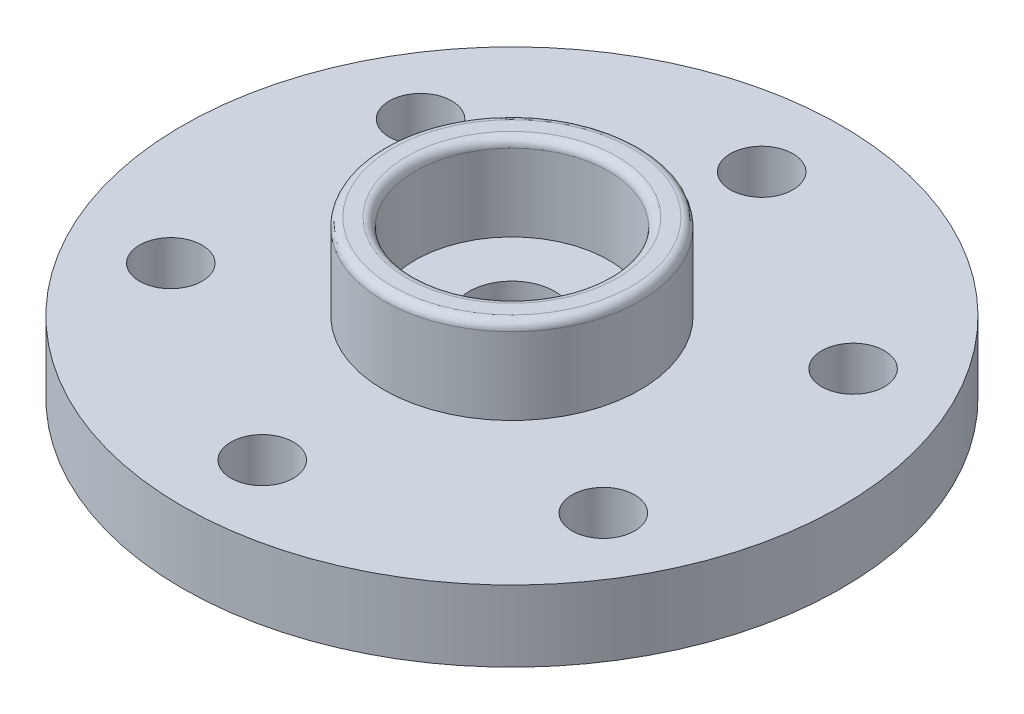
ISO-10303-21;
HEADER;
FILE_DESCRIPTION(('STEP AP214'),'2;1');
FILE_NAME('part.step','',(''),(''),'','','');
FILE_SCHEMA(('AUTOMOTIVE_DESIGN { 1 0 10303 214 1 1 1 1 }'));
ENDSEC;
DATA;
#1=APPLICATION_CONTEXT('core data for automotive mechanical design processes');
#2=APPLICATION_PROTOCOL_DEFINITION('international standard','automotive_design',2000,#1);
#3=PRODUCT_CONTEXT('',#1,'mechanical');
#4=PRODUCT('Part','Part','',(#3));
#5=PRODUCT_RELATED_PRODUCT_CATEGORY('part','',(#4));
#6=PRODUCT_DEFINITION_FORMATION('','',#4);
#7=PRODUCT_DEFINITION_CONTEXT('part definition',#1,'design');
#8=PRODUCT_DEFINITION('design','',#6,#7);
#9=PRODUCT_DEFINITION_SHAPE('','',#8);
#10=(LENGTH_UNIT() NAMED_UNIT(*) SI_UNIT(.MILLI.,.METRE.));
#11=(NAMED_UNIT(*) PLANE_ANGLE_UNIT() SI_UNIT($,.RADIAN.));
#12=(NAMED_UNIT(*) SI_UNIT($,.STERADIAN.) SOLID_ANGLE_UNIT());
#13=UNCERTAINTY_MEASURE_WITH_UNIT(LENGTH_MEASURE(1.E-05),#10,'distance_accuracy_value','');
#14=(GEOMETRIC_REPRESENTATION_CONTEXT(3) GLOBAL_UNCERTAINTY_ASSIGNED_CONTEXT((#13)) GLOBAL_UNIT_ASSIGNED_CONTEXT((#10,
#11,#12)) REPRESENTATION_CONTEXT('',''));
#15=CARTESIAN_POINT('',(0.,0.,0.));
#16=DIRECTION('',(0.,0.,1.));
#17=DIRECTION('',(1.,0.,0.));
#18=AXIS2_PLACEMENT_3D('',#15,#16,#17);
#19=CARTESIAN_POINT('',(0.,0.,0.));
#20=DIRECTION('',(0.,1.,0.));
#21=DIRECTION('',(0.,0.,1.));
#22=AXIS2_PLACEMENT_3D('',#19,#20,#21);
#23=PLANE('',#22);
#24=CARTESIAN_POINT('',(0.,0.,0.));
#25=DIRECTION('',(0.,1.,0.));
#26=DIRECTION('',(0.,0.,1.));
#27=AXIS2_PLACEMENT_3D('',#24,#25,#26);
#28=CIRCLE('',#27,3.1);
#29=CARTESIAN_POINT('',(0.,0.,3.1));
#30=VERTEX_POINT('',#29);
#31=EDGE_CURVE('E44',#30,#30,#28,.T.);
#32=ORIENTED_EDGE('',*,*,#31,.T.);
#33=EDGE_LOOP('',(#32));
#34=FACE_BOUND('',#33,.T.);
#35=CARTESIAN_POINT('',(0.,0.,0.));
#36=DIRECTION('',(0.,1.,0.));
#37=DIRECTION('',(0.,0.,1.));
#38=AXIS2_PLACEMENT_3D('',#35,#36,#37);
#39=CIRCLE('',#38,3.2);
#40=CARTESIAN_POINT('',(0.,0.,3.2));
#41=VERTEX_POINT('',#40);
#42=EDGE_CURVE('E48',#41,#41,#39,.F.);
#43=ORIENTED_EDGE('',*,*,#42,.T.);
#44=EDGE_LOOP('',(#43));
#45=FACE_BOUND('',#44,.T.);
#46=ADVANCED_FACE('F33',(#34,#45),#23,.F.);
#47=CARTESIAN_POINT('',(0.,2.5,0.));
#48=DIRECTION('',(0.,1.,0.));
#49=DIRECTION('',(0.,0.,1.));
#50=AXIS2_PLACEMENT_3D('',#47,#48,#49);
#51=PLANE('',#50);
#52=CARTESIAN_POINT('',(-7.59590881659326,2.5,-4.38550000000009));
#53=DIRECTION('',(0.,1.,0.));
#54=DIRECTION('',(0.,0.,1.));
#55=AXIS2_PLACEMENT_3D('',#52,#53,#54);
#56=CIRCLE('',#55,1.1);
#57=CARTESIAN_POINT('',(-7.59590881659326,2.5,-3.28550000000009));
#58=VERTEX_POINT('',#57);
#59=EDGE_CURVE('E129',#58,#58,#56,.F.);
#60=ORIENTED_EDGE('',*,*,#59,.T.);
#61=EDGE_LOOP('',(#60));
#62=FACE_BOUND('',#61,.T.);
#63=CARTESIAN_POINT('',(-7.59590881659335,2.5,4.38549999999993));
#64=DIRECTION('',(0.,1.,0.));
#65=DIRECTION('',(0.,0.,1.));
#66=AXIS2_PLACEMENT_3D('',#63,#64,#65);
#67=CIRCLE('',#66,1.1);
#68=CARTESIAN_POINT('',(-7.59590881659335,2.5,5.48549999999993));
#69=VERTEX_POINT('',#68);
#70=EDGE_CURVE('E123',#69,#69,#67,.F.);
#71=ORIENTED_EDGE('',*,*,#70,.T.);
#72=EDGE_LOOP('',(#71));
#73=FACE_BOUND('',#72,.T.);
#74=CARTESIAN_POINT('',(0.,2.5,8.771));
#75=DIRECTION('',(0.,1.,0.));
#76=DIRECTION('',(0.,0.,1.));
#77=AXIS2_PLACEMENT_3D('',#74,#75,#76);
#78=CIRCLE('',#77,1.1);
#79=CARTESIAN_POINT('',(0.,2.5,9.871));
#80=VERTEX_POINT('',#79);
#81=EDGE_CURVE('E117',#80,#80,#78,.F.);
#82=ORIENTED_EDGE('',*,*,#81,.T.);
#83=EDGE_LOOP('',(#82));
#84=FACE_BOUND('',#83,.T.);
#85=CARTESIAN_POINT('',(7.59590881659329,2.5,4.38550000000004));
#86=DIRECTION('',(0.,1.,0.));
#87=DIRECTION('',(0.,0.,1.));
#88=AXIS2_PLACEMENT_3D('',#85,#86,#87);
#89=CIRCLE('',#88,1.1);
#90=CARTESIAN_POINT('',(7.59590881659329,2.5,5.48550000000004));
#91=VERTEX_POINT('',#90);
#92=EDGE_CURVE('E111',#91,#91,#89,.F.);
#93=ORIENTED_EDGE('',*,*,#92,.T.);
#94=EDGE_LOOP('',(#93));
#95=FACE_BOUND('',#94,.T.);
#96=CARTESIAN_POINT('',(7.59590881659332,2.5,-4.38549999999998));
#97=DIRECTION('',(0.,1.,0.));
#98=DIRECTION('',(0.,0.,1.));
#99=AXIS2_PLACEMENT_3D('',#96,#97,#98);
#100=CIRCLE('',#99,1.1);
#101=CARTESIAN_POINT('',(7.59590881659332,2.5,-3.28549999999998));
#102=VERTEX_POINT('',#101);
#103=EDGE_CURVE('E105',#102,#102,#100,.F.);
#104=ORIENTED_EDGE('',*,*,#103,.T.);
#105=EDGE_LOOP('',(#104));
#106=FACE_BOUND('',#105,.T.);
#107=CARTESIAN_POINT('',(0.,2.5,-8.771));
#108=DIRECTION('',(0.,1.,0.));
#109=DIRECTION('',(0.,0.,1.));
#110=AXIS2_PLACEMENT_3D('',#107,#108,#109);
#111=CIRCLE('',#110,1.1);
#112=CARTESIAN_POINT('',(0.,2.5,-7.671));
#113=VERTEX_POINT('',#112);
#114=EDGE_CURVE('E99',#113,#113,#111,.F.);
#115=ORIENTED_EDGE('',*,*,#114,.T.);
#116=EDGE_LOOP('',(#115));
#117=FACE_BOUND('',#116,.T.);
#118=CARTESIAN_POINT('',(0.,2.5,0.));
#119=DIRECTION('',(0.,1.,0.));
#120=DIRECTION('',(0.,0.,1.));
#121=AXIS2_PLACEMENT_3D('',#118,#119,#120);
#122=CIRCLE('',#121,11.575);
#123=CARTESIAN_POINT('',(0.,2.5,11.575));
#124=VERTEX_POINT('',#123);
#125=EDGE_CURVE('E79',#124,#124,#122,.T.);
#126=ORIENTED_EDGE('',*,*,#125,.T.);
#127=EDGE_LOOP('',(#126));
#128=FACE_BOUND('',#127,.T.);
#129=CARTESIAN_POINT('',(0.,2.5,0.));
#130=DIRECTION('',(0.,1.,0.));
#131=DIRECTION('',(0.,0.,1.));
#132=AXIS2_PLACEMENT_3D('',#129,#130,#131);
#133=CIRCLE('',#132,4.5);
#134=CARTESIAN_POINT('',(0.,2.5,4.5));
#135=VERTEX_POINT('',#134);
#136=EDGE_CURVE('E83',#135,#135,#133,.T.);
#137=ORIENTED_EDGE('',*,*,#136,.F.);
#138=EDGE_LOOP('',(#137));
#139=FACE_BOUND('',#138,.T.);
#140=ADVANCED_FACE('F158',(#62,#73,#84,#95,#106,#117,#128,#139),#51,.T.);
#141=CARTESIAN_POINT('',(0.,2.5,0.));
#142=DIRECTION('',(0.,-1.,0.));
#143=DIRECTION('',(0.,0.,-1.));
#144=AXIS2_PLACEMENT_3D('',#141,#142,#143);
#145=CYLINDRICAL_SURFACE('',#144,11.575);
#146=ORIENTED_EDGE('',*,*,#125,.F.);
#147=EDGE_LOOP('',(#146));
#148=FACE_BOUND('',#147,.T.);
#149=CARTESIAN_POINT('',(0.,0.,0.));
#150=DIRECTION('',(0.,1.,0.));
#151=DIRECTION('',(0.,0.,1.));
#152=AXIS2_PLACEMENT_3D('',#149,#150,#151);
#153=CIRCLE('',#152,11.575);
#154=CARTESIAN_POINT('',(0.,0.,11.575));
#155=VERTEX_POINT('',#154);
#156=EDGE_CURVE('E80',#155,#155,#153,.T.);
#157=ORIENTED_EDGE('',*,*,#156,.T.);
#158=EDGE_LOOP('',(#157));
#159=FACE_BOUND('',#158,.T.);
#160=ADVANCED_FACE('F141',(#148,#159),#145,.T.);
#161=CARTESIAN_POINT('',(-7.59590881659326,0.,-4.38550000000009));
#162=DIRECTION('',(0.,-1.,0.));
#163=DIRECTION('',(-0.866025403784433,0.,-0.50000000000001));
#164=AXIS2_PLACEMENT_3D('',#161,#162,#163);
#165=CIRCLE('',#164,1.1);
#166=CARTESIAN_POINT('',(-8.54853676075614,0.,-4.9355000000001));
#167=VERTEX_POINT('',#166);
#168=EDGE_CURVE('E126',#167,#167,#165,.T.);
#169=ORIENTED_EDGE('',*,*,#168,.F.);
#170=EDGE_LOOP('',(#169));
#171=FACE_BOUND('',#170,.T.);
#172=CARTESIAN_POINT('',(-7.59590881659335,0.,4.38549999999993));
#173=DIRECTION('',(0.,-1.,0.));
#174=DIRECTION('',(-0.866025403784443,0.,0.499999999999992));
#175=AXIS2_PLACEMENT_3D('',#172,#173,#174);
#176=CIRCLE('',#175,1.1);
#177=CARTESIAN_POINT('',(-8.54853676075624,0.,4.93549999999992));
#178=VERTEX_POINT('',#177);
#179=EDGE_CURVE('E120',#178,#178,#176,.T.);
#180=ORIENTED_EDGE('',*,*,#179,.F.);
#181=EDGE_LOOP('',(#180));
#182=FACE_BOUND('',#181,.T.);
#183=CARTESIAN_POINT('',(0.,0.,8.771));
#184=DIRECTION('',(0.,-1.,0.));
#185=DIRECTION('',(0.,0.,1.));
#186=AXIS2_PLACEMENT_3D('',#183,#184,#185);
#187=CIRCLE('',#186,1.1);
#188=CARTESIAN_POINT('',(0.,0.,9.871));
#189=VERTEX_POINT('',#188);
#190=EDGE_CURVE('E114',#189,#189,#187,.T.);
#191=ORIENTED_EDGE('',*,*,#190,.F.);
#192=EDGE_LOOP('',(#191));
#193=FACE_BOUND('',#192,.T.);
#194=CARTESIAN_POINT('',(7.59590881659329,0.,4.38550000000004));
#195=DIRECTION('',(0.,-1.,0.));
#196=DIRECTION('',(0.866025403784436,0.,0.500000000000004));
#197=AXIS2_PLACEMENT_3D('',#194,#195,#196);
#198=CIRCLE('',#197,1.1);
#199=CARTESIAN_POINT('',(8.54853676075617,0.,4.93550000000004));
#200=VERTEX_POINT('',#199);
#201=EDGE_CURVE('E108',#200,#200,#198,.T.);
#202=ORIENTED_EDGE('',*,*,#201,.F.);
#203=EDGE_LOOP('',(#202));
#204=FACE_BOUND('',#203,.T.);
#205=CARTESIAN_POINT('',(7.59590881659332,0.,-4.38549999999998));
#206=DIRECTION('',(0.,-1.,0.));
#207=DIRECTION('',(0.86602540378444,0.,-0.499999999999998));
#208=AXIS2_PLACEMENT_3D('',#205,#206,#207);
#209=CIRCLE('',#208,1.1);
#210=CARTESIAN_POINT('',(8.54853676075621,0.,-4.93549999999998));
#211=VERTEX_POINT('',#210);
#212=EDGE_CURVE('E102',#211,#211,#209,.T.);
#213=ORIENTED_EDGE('',*,*,#212,.F.);
#214=EDGE_LOOP('',(#213));
#215=FACE_BOUND('',#214,.T.);
#216=CARTESIAN_POINT('',(0.,0.,-8.771));
#217=DIRECTION('',(0.,-1.,0.));
#218=DIRECTION('',(0.,0.,-1.));
#219=AXIS2_PLACEMENT_3D('',#216,#217,#218);
#220=CIRCLE('',#219,1.1);
#221=CARTESIAN_POINT('',(0.,0.,-9.871));
#222=VERTEX_POINT('',#221);
#223=EDGE_CURVE('E98',#222,#222,#220,.T.);
#224=ORIENTED_EDGE('',*,*,#223,.F.);
#225=EDGE_LOOP('',(#224));
#226=FACE_BOUND('',#225,.T.);
#227=CARTESIAN_POINT('',(0.,0.,0.));
#228=DIRECTION('',(0.,1.,0.));
#229=DIRECTION('',(0.,0.,1.));
#230=AXIS2_PLACEMENT_3D('',#227,#228,#229);
#231=CIRCLE('',#230,4.8);
#232=CARTESIAN_POINT('',(0.,0.,4.8));
#233=VERTEX_POINT('',#232);
#234=EDGE_CURVE('E56',#233,#233,#231,.T.);
#235=ORIENTED_EDGE('',*,*,#234,.T.);
#236=EDGE_LOOP('',(#235));
#237=FACE_BOUND('',#236,.T.);
#238=ORIENTED_EDGE('',*,*,#156,.F.);
#239=EDGE_LOOP('',(#238));
#240=FACE_BOUND('',#239,.T.);
#241=ADVANCED_FACE('F137',(#171,#182,#193,#204,#215,#226,#237,#240),#23,.F.);
#242=CARTESIAN_POINT('',(0.,5.5,0.));
#243=DIRECTION('',(0.,1.,0.));
#244=DIRECTION('',(0.,0.,1.));
#245=AXIS2_PLACEMENT_3D('',#242,#243,#244);
#246=PLANE('',#245);
#247=CARTESIAN_POINT('',(0.,5.5,0.));
#248=DIRECTION('',(0.,1.,0.));
#249=DIRECTION('',(0.,0.,1.));
#250=AXIS2_PLACEMENT_3D('',#247,#248,#249);
#251=CIRCLE('',#250,3.7);
#252=CARTESIAN_POINT('',(0.,5.5,3.7));
#253=VERTEX_POINT('',#252);
#254=EDGE_CURVE('E62',#253,#253,#251,.F.);
#255=ORIENTED_EDGE('',*,*,#254,.T.);
#256=EDGE_LOOP('',(#255));
#257=FACE_BOUND('',#256,.T.);
#258=CARTESIAN_POINT('',(0.,5.5,0.));
#259=DIRECTION('',(0.,1.,0.));
#260=DIRECTION('',(0.,0.,1.));
#261=AXIS2_PLACEMENT_3D('',#258,#259,#260);
#262=CIRCLE('',#261,4.2);
#263=CARTESIAN_POINT('',(0.,5.5,4.2));
#264=VERTEX_POINT('',#263);
#265=EDGE_CURVE('E65',#264,#264,#262,.T.);
#266=ORIENTED_EDGE('',*,*,#265,.T.);
#267=EDGE_LOOP('',(#266));
#268=FACE_BOUND('',#267,.T.);
#269=ADVANCED_FACE('F140',(#257,#268),#246,.T.);
#270=CARTESIAN_POINT('',(0.,5.5,0.));
#271=DIRECTION('',(0.,-1.,0.));
#272=DIRECTION('',(0.,0.,-1.));
#273=AXIS2_PLACEMENT_3D('',#270,#271,#272);
#274=CYLINDRICAL_SURFACE('',#273,4.5);
#275=CARTESIAN_POINT('',(0.,5.2,0.));
#276=DIRECTION('',(0.,1.,0.));
#277=DIRECTION('',(0.,0.,1.));
#278=AXIS2_PLACEMENT_3D('',#275,#276,#277);
#279=CIRCLE('',#278,4.5);
#280=CARTESIAN_POINT('',(0.,5.2,4.5));
#281=VERTEX_POINT('',#280);
#282=EDGE_CURVE('E11',#281,#281,#279,.F.);
#283=ORIENTED_EDGE('',*,*,#282,.T.);
#284=EDGE_LOOP('',(#283));
#285=FACE_BOUND('',#284,.T.);
#286=ORIENTED_EDGE('',*,*,#136,.T.);
#287=EDGE_LOOP('',(#286));
#288=FACE_BOUND('',#287,.T.);
#289=ADVANCED_FACE('F179',(#285,#288),#274,.T.);
#290=CARTESIAN_POINT('',(0.,5.5,0.));
#291=DIRECTION('',(0.,-1.,0.));
#292=DIRECTION('',(0.,0.,-1.));
#293=AXIS2_PLACEMENT_3D('',#290,#291,#292);
#294=CYLINDRICAL_SURFACE('',#293,3.4);
#295=CARTESIAN_POINT('',(0.,5.2,0.));
#296=DIRECTION('',(0.,1.,0.));
#297=DIRECTION('',(0.,0.,1.));
#298=AXIS2_PLACEMENT_3D('',#295,#296,#297);
#299=CIRCLE('',#298,3.4);
#300=CARTESIAN_POINT('',(0.,5.2,3.4));
#301=VERTEX_POINT('',#300);
#302=EDGE_CURVE('E68',#301,#301,#299,.T.);
#303=ORIENTED_EDGE('',*,*,#302,.T.);
#304=EDGE_LOOP('',(#303));
#305=FACE_BOUND('',#304,.T.);
#306=CARTESIAN_POINT('',(0.,2.5,0.));
#307=DIRECTION('',(0.,1.,0.));
#308=DIRECTION('',(0.,0.,1.));
#309=AXIS2_PLACEMENT_3D('',#306,#307,#308);
#310=CIRCLE('',#309,3.4);
#311=CARTESIAN_POINT('',(0.,2.5,3.4));
#312=VERTEX_POINT('',#311);
#313=EDGE_CURVE('E71',#312,#312,#310,.F.);
#314=ORIENTED_EDGE('',*,*,#313,.T.);
#315=EDGE_LOOP('',(#314));
#316=FACE_BOUND('',#315,.T.);
#317=ADVANCED_FACE('F177',(#305,#316),#294,.F.);
#318=CARTESIAN_POINT('',(0.,2.5,0.));
#319=DIRECTION('',(0.,1.,0.));
#320=DIRECTION('',(0.,0.,1.));
#321=AXIS2_PLACEMENT_3D('',#318,#319,#320);
#322=CIRCLE('',#321,1.5);
#323=CARTESIAN_POINT('',(0.,2.5,1.5));
#324=VERTEX_POINT('',#323);
#325=EDGE_CURVE('E75',#324,#324,#322,.F.);
#326=ORIENTED_EDGE('',*,*,#325,.T.);
#327=EDGE_LOOP('',(#326));
#328=FACE_BOUND('',#327,.T.);
#329=ORIENTED_EDGE('',*,*,#313,.F.);
#330=EDGE_LOOP('',(#329));
#331=FACE_BOUND('',#330,.T.);
#332=ADVANCED_FACE('F166',(#328,#331),#51,.T.);
#333=CARTESIAN_POINT('',(0.,5.501,0.));
#334=DIRECTION('',(0.,-1.,0.));
#335=DIRECTION('',(0.,0.,-1.));
#336=AXIS2_PLACEMENT_3D('',#333,#334,#335);
#337=CYLINDRICAL_SURFACE('',#336,1.5);
#338=CARTESIAN_POINT('',(0.,1.,0.));
#339=DIRECTION('',(0.,1.,0.));
#340=DIRECTION('',(0.,0.,1.));
#341=AXIS2_PLACEMENT_3D('',#338,#339,#340);
#342=CIRCLE('',#341,1.5);
#343=CARTESIAN_POINT('',(0.,1.,1.5));
#344=VERTEX_POINT('',#343);
#345=EDGE_CURVE('E72',#344,#344,#342,.F.);
#346=ORIENTED_EDGE('',*,*,#345,.T.);
#347=EDGE_LOOP('',(#346));
#348=FACE_BOUND('',#347,.T.);
#349=ORIENTED_EDGE('',*,*,#325,.F.);
#350=EDGE_LOOP('',(#349));
#351=FACE_BOUND('',#350,.T.);
#352=ADVANCED_FACE('F176',(#348,#351),#337,.F.);
#353=CARTESIAN_POINT('',(0.,1.,0.));
#354=DIRECTION('',(0.,1.,0.));
#355=DIRECTION('',(0.,0.,1.));
#356=AXIS2_PLACEMENT_3D('',#353,#354,#355);
#357=PLANE('',#356);
#358=CARTESIAN_POINT('',(0.,0.999999999999999,0.));
#359=DIRECTION('',(0.,1.,0.));
#360=DIRECTION('',(0.,0.,1.));
#361=AXIS2_PLACEMENT_3D('',#358,#359,#360);
#362=CIRCLE('',#361,2.8);
#363=CARTESIAN_POINT('',(0.,0.999999999999999,2.8));
#364=VERTEX_POINT('',#363);
#365=EDGE_CURVE('E76',#364,#364,#362,.F.);
#366=ORIENTED_EDGE('',*,*,#365,.T.);
#367=EDGE_LOOP('',(#366));
#368=FACE_BOUND('',#367,.T.);
#369=ORIENTED_EDGE('',*,*,#345,.F.);
#370=EDGE_LOOP('',(#369));
#371=FACE_BOUND('',#370,.T.);
#372=ADVANCED_FACE('F190',(#368,#371),#357,.F.);
#373=CARTESIAN_POINT('',(0.,10.4195959492893,0.));
#374=DIRECTION('',(0.,-1.,0.));
#375=DIRECTION('',(0.,0.,-1.));
#376=AXIS2_PLACEMENT_3D('',#373,#374,#375);
#377=CYLINDRICAL_SURFACE('',#376,2.8);
#378=CARTESIAN_POINT('',(0.,0.3,0.));
#379=DIRECTION('',(0.,1.,0.));
#380=DIRECTION('',(0.,0.,1.));
#381=AXIS2_PLACEMENT_3D('',#378,#379,#380);
#382=CIRCLE('',#381,2.8);
#383=CARTESIAN_POINT('',(0.,0.3,2.8));
#384=VERTEX_POINT('',#383);
#385=EDGE_CURVE('E53',#384,#384,#382,.F.);
#386=ORIENTED_EDGE('',*,*,#385,.T.);
#387=EDGE_LOOP('',(#386));
#388=FACE_BOUND('',#387,.T.);
#389=ORIENTED_EDGE('',*,*,#365,.F.);
#390=EDGE_LOOP('',(#389));
#391=FACE_BOUND('',#390,.T.);
#392=ADVANCED_FACE('F194',(#388,#391),#377,.F.);
#393=CARTESIAN_POINT('',(0.,0.5,0.));
#394=DIRECTION('',(0.,-1.,0.));
#395=DIRECTION('',(0.,0.,-1.));
#396=AXIS2_PLACEMENT_3D('',#393,#394,#395);
#397=CYLINDRICAL_SURFACE('',#396,4.5);
#398=CARTESIAN_POINT('',(0.,0.3,0.));
#399=DIRECTION('',(0.,1.,0.));
#400=DIRECTION('',(0.,0.,1.));
#401=AXIS2_PLACEMENT_3D('',#398,#399,#400);
#402=CIRCLE('',#401,4.5);
#403=CARTESIAN_POINT('',(0.,0.3,4.5));
#404=VERTEX_POINT('',#403);
#405=EDGE_CURVE('E59',#404,#404,#402,.F.);
#406=ORIENTED_EDGE('',*,*,#405,.T.);
#407=EDGE_LOOP('',(#406));
#408=FACE_BOUND('',#407,.T.);
#409=CARTESIAN_POINT('',(0.,0.5,0.));
#410=DIRECTION('',(0.,-1.,0.));
#411=DIRECTION('',(0.,0.,-1.));
#412=AXIS2_PLACEMENT_3D('',#409,#410,#411);
#413=CIRCLE('',#412,4.5);
#414=CARTESIAN_POINT('',(0.,0.5,-4.5));
#415=VERTEX_POINT('',#414);
#416=EDGE_CURVE('E92',#415,#415,#413,.T.);
#417=ORIENTED_EDGE('',*,*,#416,.F.);
#418=EDGE_LOOP('',(#417));
#419=FACE_BOUND('',#418,.T.);
#420=ADVANCED_FACE('F198',(#408,#419),#397,.F.);
#421=CARTESIAN_POINT('',(0.,0.5,0.));
#422=DIRECTION('',(0.,-1.,0.));
#423=DIRECTION('',(0.,0.,-1.));
#424=AXIS2_PLACEMENT_3D('',#421,#422,#423);
#425=PLANE('',#424);
#426=CARTESIAN_POINT('',(0.,0.5,0.));
#427=DIRECTION('',(0.,-1.,0.));
#428=DIRECTION('',(0.,0.,-1.));
#429=AXIS2_PLACEMENT_3D('',#426,#427,#428);
#430=CIRCLE('',#429,3.5);
#431=CARTESIAN_POINT('',(0.,0.5,-3.5));
#432=VERTEX_POINT('',#431);
#433=EDGE_CURVE('E95',#432,#432,#430,.T.);
#434=ORIENTED_EDGE('',*,*,#433,.F.);
#435=EDGE_LOOP('',(#434));
#436=FACE_BOUND('',#435,.T.);
#437=ORIENTED_EDGE('',*,*,#416,.T.);
#438=EDGE_LOOP('',(#437));
#439=FACE_BOUND('',#438,.T.);
#440=ADVANCED_FACE('F202',(#436,#439),#425,.T.);
#441=CARTESIAN_POINT('',(0.,0.5,0.));
#442=DIRECTION('',(0.,-1.,0.));
#443=DIRECTION('',(0.,0.,-1.));
#444=AXIS2_PLACEMENT_3D('',#441,#442,#443);
#445=CYLINDRICAL_SURFACE('',#444,3.5);
#446=CARTESIAN_POINT('',(0.,0.3,0.));
#447=DIRECTION('',(0.,1.,0.));
#448=DIRECTION('',(0.,0.,1.));
#449=AXIS2_PLACEMENT_3D('',#446,#447,#448);
#450=CIRCLE('',#449,3.5);
#451=CARTESIAN_POINT('',(0.,0.3,3.5));
#452=VERTEX_POINT('',#451);
#453=EDGE_CURVE('E40',#452,#452,#450,.T.);
#454=ORIENTED_EDGE('',*,*,#453,.T.);
#455=EDGE_LOOP('',(#454));
#456=FACE_BOUND('',#455,.T.);
#457=ORIENTED_EDGE('',*,*,#433,.T.);
#458=EDGE_LOOP('',(#457));
#459=FACE_BOUND('',#458,.T.);
#460=ADVANCED_FACE('F206',(#456,#459),#445,.T.);
#461=CARTESIAN_POINT('',(0.,5.2,0.));
#462=DIRECTION('',(0.,1.,0.));
#463=DIRECTION('',(0.,0.,1.));
#464=AXIS2_PLACEMENT_3D('',#461,#462,#463);
#465=TOROIDAL_SURFACE('',#464,3.7,0.3);
#466=ORIENTED_EDGE('',*,*,#254,.F.);
#467=EDGE_LOOP('',(#466));
#468=FACE_BOUND('',#467,.T.);
#469=ORIENTED_EDGE('',*,*,#302,.F.);
#470=EDGE_LOOP('',(#469));
#471=FACE_BOUND('',#470,.T.);
#472=ADVANCED_FACE('F210',(#468,#471),#465,.T.);
#473=CARTESIAN_POINT('',(0.,0.3,0.));
#474=DIRECTION('',(0.,1.,0.));
#475=DIRECTION('',(0.,0.,1.));
#476=AXIS2_PLACEMENT_3D('',#473,#474,#475);
#477=TOROIDAL_SURFACE('',#476,4.8,0.3);
#478=ORIENTED_EDGE('',*,*,#234,.F.);
#479=EDGE_LOOP('',(#478));
#480=FACE_BOUND('',#479,.T.);
#481=ORIENTED_EDGE('',*,*,#405,.F.);
#482=EDGE_LOOP('',(#481));
#483=FACE_BOUND('',#482,.T.);
#484=ADVANCED_FACE('F297',(#480,#483),#477,.T.);
#485=CARTESIAN_POINT('',(0.,0.3,0.));
#486=DIRECTION('',(0.,1.,0.));
#487=DIRECTION('',(0.,0.,1.));
#488=AXIS2_PLACEMENT_3D('',#485,#486,#487);
#489=TOROIDAL_SURFACE('',#488,3.1,0.3);
#490=ORIENTED_EDGE('',*,*,#31,.F.);
#491=EDGE_LOOP('',(#490));
#492=FACE_BOUND('',#491,.T.);
#493=ORIENTED_EDGE('',*,*,#385,.F.);
#494=EDGE_LOOP('',(#493));
#495=FACE_BOUND('',#494,.T.);
#496=ADVANCED_FACE('F290',(#492,#495),#489,.T.);
#497=CARTESIAN_POINT('',(0.,0.3,0.));
#498=DIRECTION('',(0.,1.,0.));
#499=DIRECTION('',(0.,0.,1.));
#500=AXIS2_PLACEMENT_3D('',#497,#498,#499);
#501=TOROIDAL_SURFACE('',#500,3.2,0.3);
#502=ORIENTED_EDGE('',*,*,#453,.F.);
#503=EDGE_LOOP('',(#502));
#504=FACE_BOUND('',#503,.T.);
#505=ORIENTED_EDGE('',*,*,#42,.F.);
#506=EDGE_LOOP('',(#505));
#507=FACE_BOUND('',#506,.T.);
#508=ADVANCED_FACE('F283',(#504,#507),#501,.T.);
#509=CARTESIAN_POINT('',(0.,5.2,0.));
#510=DIRECTION('',(0.,1.,0.));
#511=DIRECTION('',(0.,0.,1.));
#512=AXIS2_PLACEMENT_3D('',#509,#510,#511);
#513=TOROIDAL_SURFACE('',#512,4.2,0.3);
#514=ORIENTED_EDGE('',*,*,#282,.F.);
#515=EDGE_LOOP('',(#514));
#516=FACE_BOUND('',#515,.T.);
#517=ORIENTED_EDGE('',*,*,#265,.F.);
#518=EDGE_LOOP('',(#517));
#519=FACE_BOUND('',#518,.T.);
#520=ADVANCED_FACE('F35',(#516,#519),#513,.T.);
#521=CARTESIAN_POINT('',(0.,5.501,-8.771));
#522=DIRECTION('',(0.,-1.,0.));
#523=DIRECTION('',(0.,0.,-1.));
#524=AXIS2_PLACEMENT_3D('',#521,#522,#523);
#525=CYLINDRICAL_SURFACE('',#524,1.1);
#526=ORIENTED_EDGE('',*,*,#114,.F.);
#527=EDGE_LOOP('',(#526));
#528=FACE_BOUND('',#527,.T.);
#529=ORIENTED_EDGE('',*,*,#223,.T.);
#530=EDGE_LOOP('',(#529));
#531=FACE_BOUND('',#530,.T.);
#532=ADVANCED_FACE('F211',(#528,#531),#525,.F.);
#533=CARTESIAN_POINT('',(7.59590881659332,5.501,-4.38549999999998));
#534=DIRECTION('',(0.,-1.,0.));
#535=DIRECTION('',(0.,0.,-1.));
#536=AXIS2_PLACEMENT_3D('',#533,#534,#535);
#537=CYLINDRICAL_SURFACE('',#536,1.1);
#538=ORIENTED_EDGE('',*,*,#103,.F.);
#539=EDGE_LOOP('',(#538));
#540=FACE_BOUND('',#539,.T.);
#541=ORIENTED_EDGE('',*,*,#212,.T.);
#542=EDGE_LOOP('',(#541));
#543=FACE_BOUND('',#542,.T.);
#544=ADVANCED_FACE('F214',(#540,#543),#537,.F.);
#545=CARTESIAN_POINT('',(7.59590881659329,5.501,4.38550000000004));
#546=DIRECTION('',(0.,-1.,0.));
#547=DIRECTION('',(0.,0.,-1.));
#548=AXIS2_PLACEMENT_3D('',#545,#546,#547);
#549=CYLINDRICAL_SURFACE('',#548,1.1);
#550=ORIENTED_EDGE('',*,*,#92,.F.);
#551=EDGE_LOOP('',(#550));
#552=FACE_BOUND('',#551,.T.);
#553=ORIENTED_EDGE('',*,*,#201,.T.);
#554=EDGE_LOOP('',(#553));
#555=FACE_BOUND('',#554,.T.);
#556=ADVANCED_FACE('F218',(#552,#555),#549,.F.);
#557=CARTESIAN_POINT('',(0.,5.501,8.771));
#558=DIRECTION('',(0.,-1.,0.));
#559=DIRECTION('',(0.,0.,-1.));
#560=AXIS2_PLACEMENT_3D('',#557,#558,#559);
#561=CYLINDRICAL_SURFACE('',#560,1.1);
#562=ORIENTED_EDGE('',*,*,#81,.F.);
#563=EDGE_LOOP('',(#562));
#564=FACE_BOUND('',#563,.T.);
#565=ORIENTED_EDGE('',*,*,#190,.T.);
#566=EDGE_LOOP('',(#565));
#567=FACE_BOUND('',#566,.T.);
#568=ADVANCED_FACE('F222',(#564,#567),#561,.F.);
#569=CARTESIAN_POINT('',(-7.59590881659335,5.501,4.38549999999993));
#570=DIRECTION('',(0.,-1.,0.));
#571=DIRECTION('',(0.,0.,-1.));
#572=AXIS2_PLACEMENT_3D('',#569,#570,#571);
#573=CYLINDRICAL_SURFACE('',#572,1.1);
#574=ORIENTED_EDGE('',*,*,#70,.F.);
#575=EDGE_LOOP('',(#574));
#576=FACE_BOUND('',#575,.T.);
#577=ORIENTED_EDGE('',*,*,#179,.T.);
#578=EDGE_LOOP('',(#577));
#579=FACE_BOUND('',#578,.T.);
#580=ADVANCED_FACE('F226',(#576,#579),#573,.F.);
#581=CARTESIAN_POINT('',(-7.59590881659326,5.501,-4.38550000000009));
#582=DIRECTION('',(0.,-1.,0.));
#583=DIRECTION('',(0.,0.,-1.));
#584=AXIS2_PLACEMENT_3D('',#581,#582,#583);
#585=CYLINDRICAL_SURFACE('',#584,1.1);
#586=ORIENTED_EDGE('',*,*,#59,.F.);
#587=EDGE_LOOP('',(#586));
#588=FACE_BOUND('',#587,.T.);
#589=ORIENTED_EDGE('',*,*,#168,.T.);
#590=EDGE_LOOP('',(#589));
#591=FACE_BOUND('',#590,.T.);
#592=ADVANCED_FACE('F135',(#588,#591),#585,.F.);
#593=CLOSED_SHELL('',(#46,#140,#160,#241,#269,#289,#317,#332,#352,#372,#392,#420,#440,#460,#472,
#484,#496,#508,#520,#532,#544,#556,#568,#580,#592));
#594=MANIFOLD_SOLID_BREP('B2',#593);
#595=ADVANCED_BREP_SHAPE_REPRESENTATION('',(#18,#594),#14);
#596=SHAPE_DEFINITION_REPRESENTATION(#9,#595);
ENDSEC;
END-ISO-10303-21;
